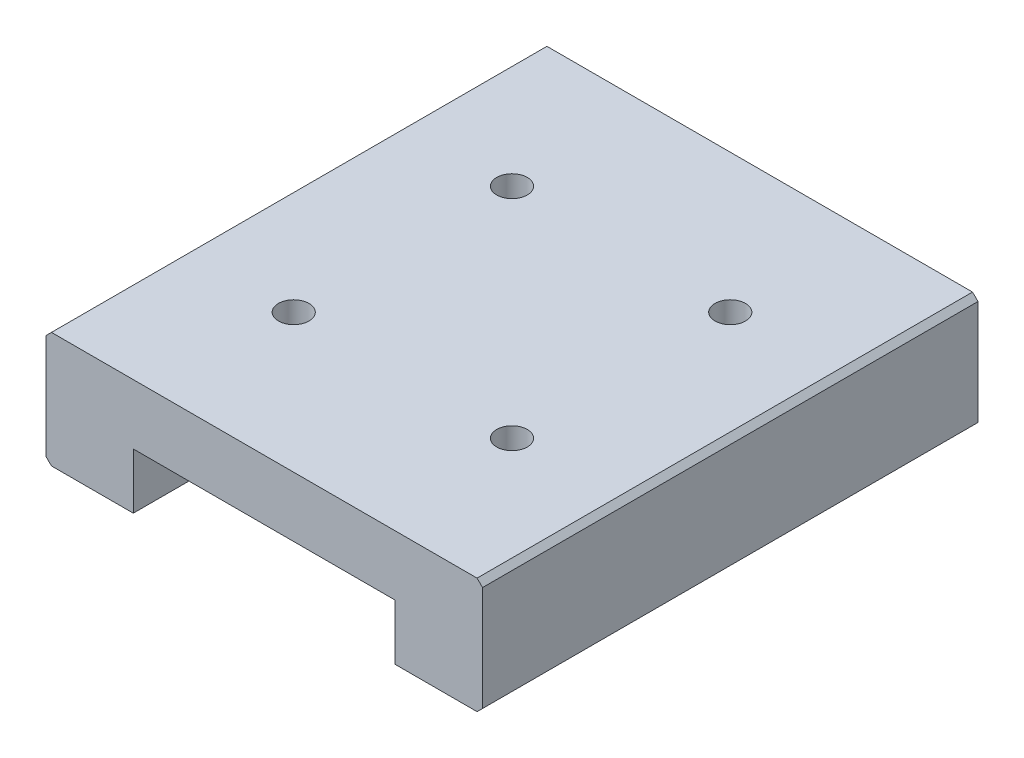
ISO-10303-21;
HEADER;
FILE_DESCRIPTION(('STEP AP214'),'2;1');
FILE_NAME('part.step','',(''),(''),'','','');
FILE_SCHEMA(('AUTOMOTIVE_DESIGN { 1 0 10303 214 1 1 1 1 }'));
ENDSEC;
DATA;
#1=APPLICATION_CONTEXT('core data for automotive mechanical design processes');
#2=APPLICATION_PROTOCOL_DEFINITION('international standard','automotive_design',2000,#1);
#3=PRODUCT_CONTEXT('',#1,'mechanical');
#4=PRODUCT('Part','Part','',(#3));
#5=PRODUCT_RELATED_PRODUCT_CATEGORY('part','',(#4));
#6=PRODUCT_DEFINITION_FORMATION('','',#4);
#7=PRODUCT_DEFINITION_CONTEXT('part definition',#1,'design');
#8=PRODUCT_DEFINITION('design','',#6,#7);
#9=PRODUCT_DEFINITION_SHAPE('','',#8);
#10=(LENGTH_UNIT() NAMED_UNIT(*) SI_UNIT(.MILLI.,.METRE.));
#11=(NAMED_UNIT(*) PLANE_ANGLE_UNIT() SI_UNIT($,.RADIAN.));
#12=(NAMED_UNIT(*) SI_UNIT($,.STERADIAN.) SOLID_ANGLE_UNIT());
#13=UNCERTAINTY_MEASURE_WITH_UNIT(LENGTH_MEASURE(1.E-05),#10,'distance_accuracy_value','');
#14=(GEOMETRIC_REPRESENTATION_CONTEXT(3) GLOBAL_UNCERTAINTY_ASSIGNED_CONTEXT((#13)) GLOBAL_UNIT_ASSIGNED_CONTEXT((#10,
#11,#12)) REPRESENTATION_CONTEXT('',''));
#15=CARTESIAN_POINT('',(0.,0.,0.));
#16=DIRECTION('',(0.,0.,1.));
#17=DIRECTION('',(1.,0.,0.));
#18=AXIS2_PLACEMENT_3D('',#15,#16,#17);
#19=CARTESIAN_POINT('',(-25.8227848101266,6.90506329113924,45.4));
#20=DIRECTION('',(-0.707106781186547,0.707106781186548,0.));
#21=DIRECTION('',(-0.707106781186548,-0.707106781186547,0.));
#22=AXIS2_PLACEMENT_3D('',#19,#20,#21);
#23=PLANE('',#22);
#24=DIRECTION('',(0.707106781186548,0.707106781186547,0.));
#25=VECTOR('',#24,1.);
#26=CARTESIAN_POINT('',(-25.8227848101266,6.90506329113924,0.));
#27=LINE('',#26,#25);
#28=CARTESIAN_POINT('',(-25.8227848101266,6.90506329113924,0.));
#29=VERTEX_POINT('',#28);
#30=CARTESIAN_POINT('',(-25.3227848101266,7.40506329113924,0.));
#31=VERTEX_POINT('',#30);
#32=EDGE_CURVE('E159',#29,#31,#27,.T.);
#33=ORIENTED_EDGE('',*,*,#32,.F.);
#34=DIRECTION('',(0.,0.,-1.));
#35=VECTOR('',#34,1.);
#36=CARTESIAN_POINT('',(-25.8227848101266,6.90506329113924,45.4));
#37=LINE('',#36,#35);
#38=CARTESIAN_POINT('',(-25.8227848101266,6.90506329113924,45.4));
#39=VERTEX_POINT('',#38);
#40=EDGE_CURVE('E11',#39,#29,#37,.T.);
#41=ORIENTED_EDGE('',*,*,#40,.F.);
#42=DIRECTION('',(0.707106781186548,0.707106781186547,0.));
#43=VECTOR('',#42,1.);
#44=CARTESIAN_POINT('',(-25.8227848101266,6.90506329113924,45.4));
#45=LINE('',#44,#43);
#46=CARTESIAN_POINT('',(-25.3227848101266,7.40506329113924,45.4));
#47=VERTEX_POINT('',#46);
#48=EDGE_CURVE('E186',#39,#47,#45,.T.);
#49=ORIENTED_EDGE('',*,*,#48,.T.);
#50=DIRECTION('',(0.,0.,-1.));
#51=VECTOR('',#50,1.);
#52=CARTESIAN_POINT('',(-25.3227848101266,7.40506329113924,45.4));
#53=LINE('',#52,#51);
#54=EDGE_CURVE('E40',#47,#31,#53,.T.);
#55=ORIENTED_EDGE('',*,*,#54,.T.);
#56=EDGE_LOOP('',(#33,#41,#49,#55));
#57=FACE_BOUND('',#56,.T.);
#58=ADVANCED_FACE('F37',(#57),#23,.T.);
#59=CARTESIAN_POINT('',(-25.8227848101266,6.90506329113924,45.4));
#60=DIRECTION('',(1.,0.,0.));
#61=DIRECTION('',(0.,0.,-1.));
#62=AXIS2_PLACEMENT_3D('',#59,#60,#61);
#63=PLANE('',#62);
#64=DIRECTION('',(0.,-1.,0.));
#65=VECTOR('',#64,1.);
#66=CARTESIAN_POINT('',(-25.8227848101266,6.90506329113924,0.));
#67=LINE('',#66,#65);
#68=CARTESIAN_POINT('',(-25.8227848101266,-2.69493670886076,0.));
#69=VERTEX_POINT('',#68);
#70=EDGE_CURVE('E94',#29,#69,#67,.T.);
#71=ORIENTED_EDGE('',*,*,#70,.T.);
#72=DIRECTION('',(0.,0.,-1.));
#73=VECTOR('',#72,1.);
#74=CARTESIAN_POINT('',(-25.8227848101266,-2.69493670886076,45.4));
#75=LINE('',#74,#73);
#76=CARTESIAN_POINT('',(-25.8227848101266,-2.69493670886076,45.4));
#77=VERTEX_POINT('',#76);
#78=EDGE_CURVE('E46',#77,#69,#75,.T.);
#79=ORIENTED_EDGE('',*,*,#78,.F.);
#80=DIRECTION('',(0.,-1.,0.));
#81=VECTOR('',#80,1.);
#82=CARTESIAN_POINT('',(-25.8227848101266,6.90506329113924,45.4));
#83=LINE('',#82,#81);
#84=EDGE_CURVE('E137',#39,#77,#83,.T.);
#85=ORIENTED_EDGE('',*,*,#84,.F.);
#86=ORIENTED_EDGE('',*,*,#40,.T.);
#87=EDGE_LOOP('',(#71,#79,#85,#86));
#88=FACE_BOUND('',#87,.T.);
#89=ADVANCED_FACE('F293',(#88),#63,.F.);
#90=CARTESIAN_POINT('',(-25.8227848101266,-2.69493670886076,45.4));
#91=DIRECTION('',(0.707106781186547,0.707106781186548,0.));
#92=DIRECTION('',(-0.707106781186548,0.707106781186547,0.));
#93=AXIS2_PLACEMENT_3D('',#90,#91,#92);
#94=PLANE('',#93);
#95=DIRECTION('',(0.707106781186548,-0.707106781186547,0.));
#96=VECTOR('',#95,1.);
#97=CARTESIAN_POINT('',(-25.8227848101266,-2.69493670886076,0.));
#98=LINE('',#97,#96);
#99=CARTESIAN_POINT('',(-25.3227848101266,-3.19493670886076,0.));
#100=VERTEX_POINT('',#99);
#101=EDGE_CURVE('E144',#69,#100,#98,.T.);
#102=ORIENTED_EDGE('',*,*,#101,.T.);
#103=DIRECTION('',(0.,0.,-1.));
#104=VECTOR('',#103,1.);
#105=CARTESIAN_POINT('',(-25.3227848101266,-3.19493670886076,45.4));
#106=LINE('',#105,#104);
#107=CARTESIAN_POINT('',(-25.3227848101266,-3.19493670886076,45.4));
#108=VERTEX_POINT('',#107);
#109=EDGE_CURVE('E141',#108,#100,#106,.T.);
#110=ORIENTED_EDGE('',*,*,#109,.F.);
#111=DIRECTION('',(0.707106781186548,-0.707106781186547,0.));
#112=VECTOR('',#111,1.);
#113=CARTESIAN_POINT('',(-25.8227848101266,-2.69493670886076,45.4));
#114=LINE('',#113,#112);
#115=EDGE_CURVE('E130',#77,#108,#114,.T.);
#116=ORIENTED_EDGE('',*,*,#115,.F.);
#117=ORIENTED_EDGE('',*,*,#78,.T.);
#118=EDGE_LOOP('',(#102,#110,#116,#117));
#119=FACE_BOUND('',#118,.T.);
#120=ADVANCED_FACE('F142',(#119),#94,.F.);
#121=CARTESIAN_POINT('',(-25.3227848101266,-3.19493670886076,45.4));
#122=DIRECTION('',(0.,1.,0.));
#123=DIRECTION('',(-1.,0.,0.));
#124=AXIS2_PLACEMENT_3D('',#121,#122,#123);
#125=PLANE('',#124);
#126=DIRECTION('',(1.,0.,0.));
#127=VECTOR('',#126,1.);
#128=CARTESIAN_POINT('',(-25.3227848101266,-3.19493670886076,0.));
#129=LINE('',#128,#127);
#130=CARTESIAN_POINT('',(-17.8227848101266,-3.19493670886076,0.));
#131=VERTEX_POINT('',#130);
#132=EDGE_CURVE('E183',#100,#131,#129,.T.);
#133=ORIENTED_EDGE('',*,*,#132,.T.);
#134=DIRECTION('',(0.,0.,-1.));
#135=VECTOR('',#134,1.);
#136=CARTESIAN_POINT('',(-17.8227848101266,-3.19493670886076,45.4));
#137=LINE('',#136,#135);
#138=CARTESIAN_POINT('',(-17.8227848101266,-3.19493670886076,45.4));
#139=VERTEX_POINT('',#138);
#140=EDGE_CURVE('E147',#139,#131,#137,.T.);
#141=ORIENTED_EDGE('',*,*,#140,.F.);
#142=DIRECTION('',(1.,0.,0.));
#143=VECTOR('',#142,1.);
#144=CARTESIAN_POINT('',(-25.3227848101266,-3.19493670886076,45.4));
#145=LINE('',#144,#143);
#146=EDGE_CURVE('E135',#108,#139,#145,.T.);
#147=ORIENTED_EDGE('',*,*,#146,.F.);
#148=ORIENTED_EDGE('',*,*,#109,.T.);
#149=EDGE_LOOP('',(#133,#141,#147,#148));
#150=FACE_BOUND('',#149,.T.);
#151=ADVANCED_FACE('F149',(#150),#125,.F.);
#152=CARTESIAN_POINT('',(-17.8227848101266,-3.19493670886076,45.4));
#153=DIRECTION('',(-1.,0.,0.));
#154=DIRECTION('',(0.,-1.,0.));
#155=AXIS2_PLACEMENT_3D('',#152,#153,#154);
#156=PLANE('',#155);
#157=DIRECTION('',(0.,1.,0.));
#158=VECTOR('',#157,1.);
#159=CARTESIAN_POINT('',(-17.8227848101266,-3.19493670886076,0.));
#160=LINE('',#159,#158);
#161=CARTESIAN_POINT('',(-17.8227848101266,1.90506329113924,0.));
#162=VERTEX_POINT('',#161);
#163=EDGE_CURVE('E181',#131,#162,#160,.T.);
#164=ORIENTED_EDGE('',*,*,#163,.T.);
#165=DIRECTION('',(0.,0.,-1.));
#166=VECTOR('',#165,1.);
#167=CARTESIAN_POINT('',(-17.8227848101266,1.90506329113924,45.4));
#168=LINE('',#167,#166);
#169=CARTESIAN_POINT('',(-17.8227848101266,1.90506329113924,45.4));
#170=VERTEX_POINT('',#169);
#171=EDGE_CURVE('E190',#170,#162,#168,.T.);
#172=ORIENTED_EDGE('',*,*,#171,.F.);
#173=DIRECTION('',(0.,1.,0.));
#174=VECTOR('',#173,1.);
#175=CARTESIAN_POINT('',(-17.8227848101266,-3.19493670886076,45.4));
#176=LINE('',#175,#174);
#177=EDGE_CURVE('E152',#139,#170,#176,.T.);
#178=ORIENTED_EDGE('',*,*,#177,.F.);
#179=ORIENTED_EDGE('',*,*,#140,.T.);
#180=EDGE_LOOP('',(#164,#172,#178,#179));
#181=FACE_BOUND('',#180,.T.);
#182=ADVANCED_FACE('F213',(#181),#156,.F.);
#183=CARTESIAN_POINT('',(-17.8227848101266,1.90506329113924,45.4));
#184=DIRECTION('',(0.,1.,0.));
#185=DIRECTION('',(0.,0.,1.));
#186=AXIS2_PLACEMENT_3D('',#183,#184,#185);
#187=PLANE('',#186);
#188=DIRECTION('',(1.,0.,0.));
#189=VECTOR('',#188,1.);
#190=CARTESIAN_POINT('',(-17.8227848101266,1.90506329113924,0.));
#191=LINE('',#190,#189);
#192=CARTESIAN_POINT('',(6.17721518987342,1.90506329113924,0.));
#193=VERTEX_POINT('',#192);
#194=EDGE_CURVE('E179',#162,#193,#191,.T.);
#195=ORIENTED_EDGE('',*,*,#194,.T.);
#196=DIRECTION('',(0.,0.,-1.));
#197=VECTOR('',#196,1.);
#198=CARTESIAN_POINT('',(6.17721518987342,1.90506329113924,45.4));
#199=LINE('',#198,#197);
#200=CARTESIAN_POINT('',(6.17721518987342,1.90506329113924,45.4));
#201=VERTEX_POINT('',#200);
#202=EDGE_CURVE('E193',#201,#193,#199,.T.);
#203=ORIENTED_EDGE('',*,*,#202,.F.);
#204=DIRECTION('',(1.,0.,0.));
#205=VECTOR('',#204,1.);
#206=CARTESIAN_POINT('',(-17.8227848101266,1.90506329113924,45.4));
#207=LINE('',#206,#205);
#208=EDGE_CURVE('E154',#170,#201,#207,.T.);
#209=ORIENTED_EDGE('',*,*,#208,.F.);
#210=ORIENTED_EDGE('',*,*,#171,.T.);
#211=EDGE_LOOP('',(#195,#203,#209,#210));
#212=FACE_BOUND('',#211,.T.);
#213=ADVANCED_FACE('F221',(#212),#187,.F.);
#214=CARTESIAN_POINT('',(6.17721518987342,1.90506329113924,45.4));
#215=DIRECTION('',(1.,0.,0.));
#216=DIRECTION('',(0.,0.,-1.));
#217=AXIS2_PLACEMENT_3D('',#214,#215,#216);
#218=PLANE('',#217);
#219=DIRECTION('',(0.,-1.,0.));
#220=VECTOR('',#219,1.);
#221=CARTESIAN_POINT('',(6.17721518987342,1.90506329113924,0.));
#222=LINE('',#221,#220);
#223=CARTESIAN_POINT('',(6.17721518987342,-3.19493670886076,0.));
#224=VERTEX_POINT('',#223);
#225=EDGE_CURVE('E177',#193,#224,#222,.T.);
#226=ORIENTED_EDGE('',*,*,#225,.T.);
#227=DIRECTION('',(0.,0.,-1.));
#228=VECTOR('',#227,1.);
#229=CARTESIAN_POINT('',(6.17721518987342,-3.19493670886076,45.4));
#230=LINE('',#229,#228);
#231=CARTESIAN_POINT('',(6.17721518987342,-3.19493670886076,45.4));
#232=VERTEX_POINT('',#231);
#233=EDGE_CURVE('E196',#232,#224,#230,.T.);
#234=ORIENTED_EDGE('',*,*,#233,.F.);
#235=DIRECTION('',(0.,-1.,0.));
#236=VECTOR('',#235,1.);
#237=CARTESIAN_POINT('',(6.17721518987342,1.90506329113924,45.4));
#238=LINE('',#237,#236);
#239=EDGE_CURVE('E218',#201,#232,#238,.T.);
#240=ORIENTED_EDGE('',*,*,#239,.F.);
#241=ORIENTED_EDGE('',*,*,#202,.T.);
#242=EDGE_LOOP('',(#226,#234,#240,#241));
#243=FACE_BOUND('',#242,.T.);
#244=ADVANCED_FACE('F224',(#243),#218,.F.);
#245=CARTESIAN_POINT('',(6.17721518987342,-3.19493670886076,45.4));
#246=DIRECTION('',(0.,1.,0.));
#247=DIRECTION('',(-1.,0.,0.));
#248=AXIS2_PLACEMENT_3D('',#245,#246,#247);
#249=PLANE('',#248);
#250=DIRECTION('',(1.,0.,0.));
#251=VECTOR('',#250,1.);
#252=CARTESIAN_POINT('',(6.17721518987342,-3.19493670886076,0.));
#253=LINE('',#252,#251);
#254=CARTESIAN_POINT('',(13.6772151898734,-3.19493670886076,0.));
#255=VERTEX_POINT('',#254);
#256=EDGE_CURVE('E175',#224,#255,#253,.T.);
#257=ORIENTED_EDGE('',*,*,#256,.T.);
#258=DIRECTION('',(0.,0.,-1.));
#259=VECTOR('',#258,1.);
#260=CARTESIAN_POINT('',(13.6772151898734,-3.19493670886076,45.4));
#261=LINE('',#260,#259);
#262=CARTESIAN_POINT('',(13.6772151898734,-3.19493670886076,45.4));
#263=VERTEX_POINT('',#262);
#264=EDGE_CURVE('E199',#263,#255,#261,.T.);
#265=ORIENTED_EDGE('',*,*,#264,.F.);
#266=DIRECTION('',(1.,0.,0.));
#267=VECTOR('',#266,1.);
#268=CARTESIAN_POINT('',(6.17721518987342,-3.19493670886076,45.4));
#269=LINE('',#268,#267);
#270=EDGE_CURVE('E226',#232,#263,#269,.T.);
#271=ORIENTED_EDGE('',*,*,#270,.F.);
#272=ORIENTED_EDGE('',*,*,#233,.T.);
#273=EDGE_LOOP('',(#257,#265,#271,#272));
#274=FACE_BOUND('',#273,.T.);
#275=ADVANCED_FACE('F313',(#274),#249,.F.);
#276=CARTESIAN_POINT('',(13.6772151898734,-3.19493670886076,45.4));
#277=DIRECTION('',(-0.707106781186547,0.707106781186548,0.));
#278=DIRECTION('',(-0.707106781186548,-0.707106781186547,0.));
#279=AXIS2_PLACEMENT_3D('',#276,#277,#278);
#280=PLANE('',#279);
#281=DIRECTION('',(0.707106781186548,0.707106781186547,0.));
#282=VECTOR('',#281,1.);
#283=CARTESIAN_POINT('',(13.6772151898734,-3.19493670886076,0.));
#284=LINE('',#283,#282);
#285=CARTESIAN_POINT('',(14.1772151898734,-2.69493670886076,0.));
#286=VERTEX_POINT('',#285);
#287=EDGE_CURVE('E172',#255,#286,#284,.T.);
#288=ORIENTED_EDGE('',*,*,#287,.T.);
#289=DIRECTION('',(0.,0.,-1.));
#290=VECTOR('',#289,1.);
#291=CARTESIAN_POINT('',(14.1772151898734,-2.69493670886076,45.4));
#292=LINE('',#291,#290);
#293=CARTESIAN_POINT('',(14.1772151898734,-2.69493670886076,45.4));
#294=VERTEX_POINT('',#293);
#295=EDGE_CURVE('E202',#294,#286,#292,.T.);
#296=ORIENTED_EDGE('',*,*,#295,.F.);
#297=DIRECTION('',(0.707106781186548,0.707106781186547,0.));
#298=VECTOR('',#297,1.);
#299=CARTESIAN_POINT('',(13.6772151898734,-3.19493670886076,45.4));
#300=LINE('',#299,#298);
#301=EDGE_CURVE('E228',#263,#294,#300,.T.);
#302=ORIENTED_EDGE('',*,*,#301,.F.);
#303=ORIENTED_EDGE('',*,*,#264,.T.);
#304=EDGE_LOOP('',(#288,#296,#302,#303));
#305=FACE_BOUND('',#304,.T.);
#306=ADVANCED_FACE('F316',(#305),#280,.F.);
#307=CARTESIAN_POINT('',(14.1772151898734,6.90506329113924,45.4));
#308=DIRECTION('',(1.,0.,0.));
#309=DIRECTION('',(0.,1.,0.));
#310=AXIS2_PLACEMENT_3D('',#307,#308,#309);
#311=PLANE('',#310);
#312=DIRECTION('',(0.,-1.,0.));
#313=VECTOR('',#312,1.);
#314=CARTESIAN_POINT('',(14.1772151898734,6.90506329113924,0.));
#315=LINE('',#314,#313);
#316=CARTESIAN_POINT('',(14.1772151898734,6.90506329113924,0.));
#317=VERTEX_POINT('',#316);
#318=EDGE_CURVE('E169',#317,#286,#315,.T.);
#319=ORIENTED_EDGE('',*,*,#318,.F.);
#320=DIRECTION('',(0.,0.,-1.));
#321=VECTOR('',#320,1.);
#322=CARTESIAN_POINT('',(14.1772151898734,6.90506329113924,45.4));
#323=LINE('',#322,#321);
#324=CARTESIAN_POINT('',(14.1772151898734,6.90506329113924,45.4));
#325=VERTEX_POINT('',#324);
#326=EDGE_CURVE('E204',#325,#317,#323,.T.);
#327=ORIENTED_EDGE('',*,*,#326,.F.);
#328=DIRECTION('',(0.,-1.,0.));
#329=VECTOR('',#328,1.);
#330=CARTESIAN_POINT('',(14.1772151898734,6.90506329113924,45.4));
#331=LINE('',#330,#329);
#332=EDGE_CURVE('E232',#325,#294,#331,.T.);
#333=ORIENTED_EDGE('',*,*,#332,.T.);
#334=ORIENTED_EDGE('',*,*,#295,.T.);
#335=EDGE_LOOP('',(#319,#327,#333,#334));
#336=FACE_BOUND('',#335,.T.);
#337=ADVANCED_FACE('F320',(#336),#311,.T.);
#338=CARTESIAN_POINT('',(13.6772151898734,7.40506329113924,45.4));
#339=DIRECTION('',(0.707106781186547,0.707106781186548,0.));
#340=DIRECTION('',(-0.707106781186548,0.707106781186547,0.));
#341=AXIS2_PLACEMENT_3D('',#338,#339,#340);
#342=PLANE('',#341);
#343=DIRECTION('',(0.707106781186548,-0.707106781186547,0.));
#344=VECTOR('',#343,1.);
#345=CARTESIAN_POINT('',(13.6772151898734,7.40506329113924,0.));
#346=LINE('',#345,#344);
#347=CARTESIAN_POINT('',(13.6772151898734,7.40506329113924,0.));
#348=VERTEX_POINT('',#347);
#349=EDGE_CURVE('E166',#348,#317,#346,.T.);
#350=ORIENTED_EDGE('',*,*,#349,.F.);
#351=DIRECTION('',(0.,0.,-1.));
#352=VECTOR('',#351,1.);
#353=CARTESIAN_POINT('',(13.6772151898734,7.40506329113924,45.4));
#354=LINE('',#353,#352);
#355=CARTESIAN_POINT('',(13.6772151898734,7.40506329113924,45.4));
#356=VERTEX_POINT('',#355);
#357=EDGE_CURVE('E205',#356,#348,#354,.T.);
#358=ORIENTED_EDGE('',*,*,#357,.F.);
#359=DIRECTION('',(0.707106781186548,-0.707106781186547,0.));
#360=VECTOR('',#359,1.);
#361=CARTESIAN_POINT('',(13.6772151898734,7.40506329113924,45.4));
#362=LINE('',#361,#360);
#363=EDGE_CURVE('E235',#356,#325,#362,.T.);
#364=ORIENTED_EDGE('',*,*,#363,.T.);
#365=ORIENTED_EDGE('',*,*,#326,.T.);
#366=EDGE_LOOP('',(#350,#358,#364,#365));
#367=FACE_BOUND('',#366,.T.);
#368=ADVANCED_FACE('F269',(#367),#342,.T.);
#369=CARTESIAN_POINT('',(-25.3227848101266,7.40506329113924,45.4));
#370=DIRECTION('',(0.,1.,0.));
#371=DIRECTION('',(0.,0.,1.));
#372=AXIS2_PLACEMENT_3D('',#369,#370,#371);
#373=PLANE('',#372);
#374=CARTESIAN_POINT('',(4.17721518987342,7.40506329113924,12.7));
#375=DIRECTION('',(0.,1.,0.));
#376=DIRECTION('',(0.,0.,1.));
#377=AXIS2_PLACEMENT_3D('',#374,#375,#376);
#378=CIRCLE('',#377,1.40000000000001);
#379=CARTESIAN_POINT('',(4.17721518987342,7.40506329113924,14.1));
#380=VERTEX_POINT('',#379);
#381=EDGE_CURVE('E261',#380,#380,#378,.T.);
#382=ORIENTED_EDGE('',*,*,#381,.F.);
#383=EDGE_LOOP('',(#382));
#384=FACE_BOUND('',#383,.T.);
#385=CARTESIAN_POINT('',(4.17721518987342,7.40506329113924,32.7));
#386=DIRECTION('',(0.,1.,0.));
#387=DIRECTION('',(0.,0.,1.));
#388=AXIS2_PLACEMENT_3D('',#385,#386,#387);
#389=CIRCLE('',#388,1.40000000000001);
#390=CARTESIAN_POINT('',(4.17721518987342,7.40506329113924,34.1));
#391=VERTEX_POINT('',#390);
#392=EDGE_CURVE('E255',#391,#391,#389,.T.);
#393=ORIENTED_EDGE('',*,*,#392,.F.);
#394=EDGE_LOOP('',(#393));
#395=FACE_BOUND('',#394,.T.);
#396=CARTESIAN_POINT('',(-15.8227848101266,7.40506329113924,12.7));
#397=DIRECTION('',(0.,1.,0.));
#398=DIRECTION('',(0.,0.,1.));
#399=AXIS2_PLACEMENT_3D('',#396,#397,#398);
#400=CIRCLE('',#399,1.40000000000001);
#401=CARTESIAN_POINT('',(-15.8227848101266,7.40506329113924,14.1));
#402=VERTEX_POINT('',#401);
#403=EDGE_CURVE('E249',#402,#402,#400,.T.);
#404=ORIENTED_EDGE('',*,*,#403,.F.);
#405=EDGE_LOOP('',(#404));
#406=FACE_BOUND('',#405,.T.);
#407=CARTESIAN_POINT('',(-15.8227848101266,7.40506329113924,32.7));
#408=DIRECTION('',(0.,1.,0.));
#409=DIRECTION('',(0.,0.,1.));
#410=AXIS2_PLACEMENT_3D('',#407,#408,#409);
#411=CIRCLE('',#410,1.40000000000001);
#412=CARTESIAN_POINT('',(-15.8227848101266,7.40506329113924,34.1));
#413=VERTEX_POINT('',#412);
#414=EDGE_CURVE('E243',#413,#413,#411,.T.);
#415=ORIENTED_EDGE('',*,*,#414,.F.);
#416=EDGE_LOOP('',(#415));
#417=FACE_BOUND('',#416,.T.);
#418=DIRECTION('',(1.,0.,0.));
#419=VECTOR('',#418,1.);
#420=CARTESIAN_POINT('',(-25.3227848101266,7.40506329113924,0.));
#421=LINE('',#420,#419);
#422=EDGE_CURVE('E162',#31,#348,#421,.T.);
#423=ORIENTED_EDGE('',*,*,#422,.F.);
#424=ORIENTED_EDGE('',*,*,#54,.F.);
#425=DIRECTION('',(1.,0.,0.));
#426=VECTOR('',#425,1.);
#427=CARTESIAN_POINT('',(-25.3227848101266,7.40506329113924,45.4));
#428=LINE('',#427,#426);
#429=EDGE_CURVE('E238',#47,#356,#428,.T.);
#430=ORIENTED_EDGE('',*,*,#429,.T.);
#431=ORIENTED_EDGE('',*,*,#357,.T.);
#432=EDGE_LOOP('',(#423,#424,#430,#431));
#433=FACE_BOUND('',#432,.T.);
#434=ADVANCED_FACE('F207',(#384,#395,#406,#417,#433),#373,.T.);
#435=CARTESIAN_POINT('',(0.,0.,45.4));
#436=DIRECTION('',(0.,0.,-1.));
#437=DIRECTION('',(-1.,0.,0.));
#438=AXIS2_PLACEMENT_3D('',#435,#436,#437);
#439=PLANE('',#438);
#440=ORIENTED_EDGE('',*,*,#48,.F.);
#441=ORIENTED_EDGE('',*,*,#84,.T.);
#442=ORIENTED_EDGE('',*,*,#115,.T.);
#443=ORIENTED_EDGE('',*,*,#146,.T.);
#444=ORIENTED_EDGE('',*,*,#177,.T.);
#445=ORIENTED_EDGE('',*,*,#208,.T.);
#446=ORIENTED_EDGE('',*,*,#239,.T.);
#447=ORIENTED_EDGE('',*,*,#270,.T.);
#448=ORIENTED_EDGE('',*,*,#301,.T.);
#449=ORIENTED_EDGE('',*,*,#332,.F.);
#450=ORIENTED_EDGE('',*,*,#363,.F.);
#451=ORIENTED_EDGE('',*,*,#429,.F.);
#452=EDGE_LOOP('',(#440,#441,#442,#443,#444,#445,#446,#447,#448,#449,#450,#451));
#453=FACE_BOUND('',#452,.T.);
#454=ADVANCED_FACE('F133',(#453),#439,.F.);
#455=CARTESIAN_POINT('',(0.,0.,0.));
#456=DIRECTION('',(0.,0.,-1.));
#457=DIRECTION('',(-1.,0.,0.));
#458=AXIS2_PLACEMENT_3D('',#455,#456,#457);
#459=PLANE('',#458);
#460=ORIENTED_EDGE('',*,*,#32,.T.);
#461=ORIENTED_EDGE('',*,*,#422,.T.);
#462=ORIENTED_EDGE('',*,*,#349,.T.);
#463=ORIENTED_EDGE('',*,*,#318,.T.);
#464=ORIENTED_EDGE('',*,*,#287,.F.);
#465=ORIENTED_EDGE('',*,*,#256,.F.);
#466=ORIENTED_EDGE('',*,*,#225,.F.);
#467=ORIENTED_EDGE('',*,*,#194,.F.);
#468=ORIENTED_EDGE('',*,*,#163,.F.);
#469=ORIENTED_EDGE('',*,*,#132,.F.);
#470=ORIENTED_EDGE('',*,*,#101,.F.);
#471=ORIENTED_EDGE('',*,*,#70,.F.);
#472=EDGE_LOOP('',(#460,#461,#462,#463,#464,#465,#466,#467,#468,#469,#470,#471));
#473=FACE_BOUND('',#472,.T.);
#474=ADVANCED_FACE('F209',(#473),#459,.T.);
#475=CARTESIAN_POINT('',(-15.8227848101266,3.90506329113924,32.7));
#476=DIRECTION('',(0.,-1.,0.));
#477=DIRECTION('',(0.,0.,-1.));
#478=AXIS2_PLACEMENT_3D('',#475,#476,#477);
#479=PLANE('',#478);
#480=CARTESIAN_POINT('',(-15.8227848101266,3.90506329113924,32.7));
#481=DIRECTION('',(0.,1.,0.));
#482=DIRECTION('',(0.,0.,1.));
#483=AXIS2_PLACEMENT_3D('',#480,#481,#482);
#484=CIRCLE('',#483,1.40000000000001);
#485=CARTESIAN_POINT('',(-15.8227848101266,3.90506329113924,34.1));
#486=VERTEX_POINT('',#485);
#487=EDGE_CURVE('E163',#486,#486,#484,.T.);
#488=ORIENTED_EDGE('',*,*,#487,.T.);
#489=EDGE_LOOP('',(#488));
#490=FACE_BOUND('',#489,.T.);
#491=ADVANCED_FACE('F279',(#490),#479,.F.);
#492=CARTESIAN_POINT('',(-15.8227848101266,7.40506329113924,32.7));
#493=DIRECTION('',(0.,1.,0.));
#494=DIRECTION('',(0.,0.,1.));
#495=AXIS2_PLACEMENT_3D('',#492,#493,#494);
#496=CYLINDRICAL_SURFACE('',#495,1.40000000000001);
#497=ORIENTED_EDGE('',*,*,#487,.F.);
#498=EDGE_LOOP('',(#497));
#499=FACE_BOUND('',#498,.T.);
#500=ORIENTED_EDGE('',*,*,#414,.T.);
#501=EDGE_LOOP('',(#500));
#502=FACE_BOUND('',#501,.T.);
#503=ADVANCED_FACE('F276',(#499,#502),#496,.F.);
#504=CARTESIAN_POINT('',(-15.8227848101266,3.90506329113924,12.7));
#505=DIRECTION('',(0.,-1.,0.));
#506=DIRECTION('',(0.,0.,-1.));
#507=AXIS2_PLACEMENT_3D('',#504,#505,#506);
#508=PLANE('',#507);
#509=CARTESIAN_POINT('',(-15.8227848101266,3.90506329113924,12.7));
#510=DIRECTION('',(0.,1.,0.));
#511=DIRECTION('',(0.,0.,1.));
#512=AXIS2_PLACEMENT_3D('',#509,#510,#511);
#513=CIRCLE('',#512,1.40000000000001);
#514=CARTESIAN_POINT('',(-15.8227848101266,3.90506329113924,14.1));
#515=VERTEX_POINT('',#514);
#516=EDGE_CURVE('E246',#515,#515,#513,.T.);
#517=ORIENTED_EDGE('',*,*,#516,.T.);
#518=EDGE_LOOP('',(#517));
#519=FACE_BOUND('',#518,.T.);
#520=ADVANCED_FACE('F278',(#519),#508,.F.);
#521=CARTESIAN_POINT('',(-15.8227848101266,7.40506329113924,12.7));
#522=DIRECTION('',(0.,1.,0.));
#523=DIRECTION('',(0.,0.,1.));
#524=AXIS2_PLACEMENT_3D('',#521,#522,#523);
#525=CYLINDRICAL_SURFACE('',#524,1.40000000000001);
#526=ORIENTED_EDGE('',*,*,#516,.F.);
#527=EDGE_LOOP('',(#526));
#528=FACE_BOUND('',#527,.T.);
#529=ORIENTED_EDGE('',*,*,#403,.T.);
#530=EDGE_LOOP('',(#529));
#531=FACE_BOUND('',#530,.T.);
#532=ADVANCED_FACE('F286',(#528,#531),#525,.F.);
#533=CARTESIAN_POINT('',(4.17721518987342,3.90506329113924,32.7));
#534=DIRECTION('',(0.,-1.,0.));
#535=DIRECTION('',(0.,0.,-1.));
#536=AXIS2_PLACEMENT_3D('',#533,#534,#535);
#537=PLANE('',#536);
#538=CARTESIAN_POINT('',(4.17721518987342,3.90506329113924,32.7));
#539=DIRECTION('',(0.,1.,0.));
#540=DIRECTION('',(0.,0.,1.));
#541=AXIS2_PLACEMENT_3D('',#538,#539,#540);
#542=CIRCLE('',#541,1.40000000000001);
#543=CARTESIAN_POINT('',(4.17721518987342,3.90506329113924,34.1));
#544=VERTEX_POINT('',#543);
#545=EDGE_CURVE('E252',#544,#544,#542,.T.);
#546=ORIENTED_EDGE('',*,*,#545,.T.);
#547=EDGE_LOOP('',(#546));
#548=FACE_BOUND('',#547,.T.);
#549=ADVANCED_FACE('F376',(#548),#537,.F.);
#550=CARTESIAN_POINT('',(4.17721518987342,7.40506329113924,32.7));
#551=DIRECTION('',(0.,1.,0.));
#552=DIRECTION('',(0.,0.,1.));
#553=AXIS2_PLACEMENT_3D('',#550,#551,#552);
#554=CYLINDRICAL_SURFACE('',#553,1.40000000000001);
#555=ORIENTED_EDGE('',*,*,#545,.F.);
#556=EDGE_LOOP('',(#555));
#557=FACE_BOUND('',#556,.T.);
#558=ORIENTED_EDGE('',*,*,#392,.T.);
#559=EDGE_LOOP('',(#558));
#560=FACE_BOUND('',#559,.T.);
#561=ADVANCED_FACE('F386',(#557,#560),#554,.F.);
#562=CARTESIAN_POINT('',(4.17721518987342,3.90506329113924,12.7));
#563=DIRECTION('',(0.,-1.,0.));
#564=DIRECTION('',(0.,0.,-1.));
#565=AXIS2_PLACEMENT_3D('',#562,#563,#564);
#566=PLANE('',#565);
#567=CARTESIAN_POINT('',(4.17721518987342,3.90506329113924,12.7));
#568=DIRECTION('',(0.,1.,0.));
#569=DIRECTION('',(0.,0.,1.));
#570=AXIS2_PLACEMENT_3D('',#567,#568,#569);
#571=CIRCLE('',#570,1.40000000000001);
#572=CARTESIAN_POINT('',(4.17721518987342,3.90506329113924,14.1));
#573=VERTEX_POINT('',#572);
#574=EDGE_CURVE('E258',#573,#573,#571,.T.);
#575=ORIENTED_EDGE('',*,*,#574,.T.);
#576=EDGE_LOOP('',(#575));
#577=FACE_BOUND('',#576,.T.);
#578=ADVANCED_FACE('F396',(#577),#566,.F.);
#579=CARTESIAN_POINT('',(4.17721518987342,7.40506329113924,12.7));
#580=DIRECTION('',(0.,1.,0.));
#581=DIRECTION('',(0.,0.,1.));
#582=AXIS2_PLACEMENT_3D('',#579,#580,#581);
#583=CYLINDRICAL_SURFACE('',#582,1.40000000000001);
#584=ORIENTED_EDGE('',*,*,#574,.F.);
#585=EDGE_LOOP('',(#584));
#586=FACE_BOUND('',#585,.T.);
#587=ORIENTED_EDGE('',*,*,#381,.T.);
#588=EDGE_LOOP('',(#587));
#589=FACE_BOUND('',#588,.T.);
#590=ADVANCED_FACE('F265',(#586,#589),#583,.F.);
#591=CLOSED_SHELL('',(#58,#89,#120,#151,#182,#213,#244,#275,#306,#337,#368,#434,#454,#474,#491,
#503,#520,#532,#549,#561,#578,#590));
#592=MANIFOLD_SOLID_BREP('B2',#591);
#593=ADVANCED_BREP_SHAPE_REPRESENTATION('',(#18,#592),#14);
#594=SHAPE_DEFINITION_REPRESENTATION(#9,#593);
ENDSEC;
END-ISO-10303-21;
